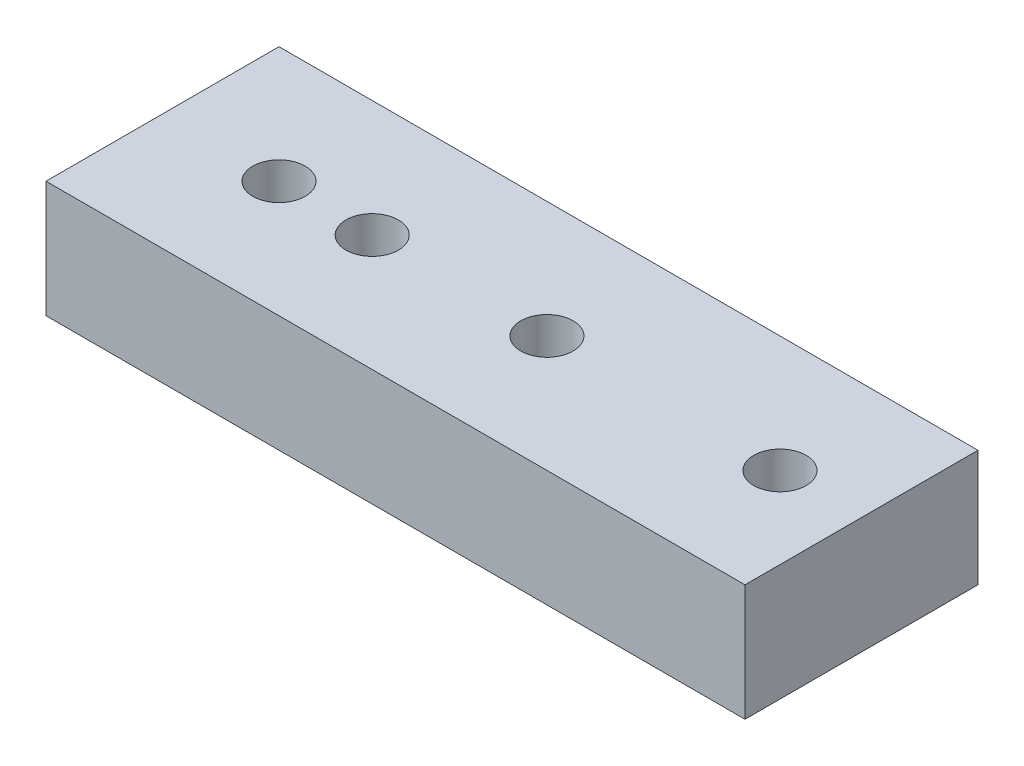
ISO-10303-21;
HEADER;
FILE_DESCRIPTION(('STEP AP214'),'2;1');
FILE_NAME('part.step','',(''),(''),'','','');
FILE_SCHEMA(('AUTOMOTIVE_DESIGN { 1 0 10303 214 1 1 1 1 }'));
ENDSEC;
DATA;
#1=APPLICATION_CONTEXT('core data for automotive mechanical design processes');
#2=APPLICATION_PROTOCOL_DEFINITION('international standard','automotive_design',2000,#1);
#3=PRODUCT_CONTEXT('',#1,'mechanical');
#4=PRODUCT('Part','Part','',(#3));
#5=PRODUCT_RELATED_PRODUCT_CATEGORY('part','',(#4));
#6=PRODUCT_DEFINITION_FORMATION('','',#4);
#7=PRODUCT_DEFINITION_CONTEXT('part definition',#1,'design');
#8=PRODUCT_DEFINITION('design','',#6,#7);
#9=PRODUCT_DEFINITION_SHAPE('','',#8);
#10=(LENGTH_UNIT() NAMED_UNIT(*) SI_UNIT(.MILLI.,.METRE.));
#11=(NAMED_UNIT(*) PLANE_ANGLE_UNIT() SI_UNIT($,.RADIAN.));
#12=(NAMED_UNIT(*) SI_UNIT($,.STERADIAN.) SOLID_ANGLE_UNIT());
#13=UNCERTAINTY_MEASURE_WITH_UNIT(LENGTH_MEASURE(1.E-05),#10,'distance_accuracy_value','');
#14=(GEOMETRIC_REPRESENTATION_CONTEXT(3) GLOBAL_UNCERTAINTY_ASSIGNED_CONTEXT((#13)) GLOBAL_UNIT_ASSIGNED_CONTEXT((#10,
#11,#12)) REPRESENTATION_CONTEXT('',''));
#15=CARTESIAN_POINT('',(0.,0.,0.));
#16=DIRECTION('',(0.,0.,1.));
#17=DIRECTION('',(1.,0.,0.));
#18=AXIS2_PLACEMENT_3D('',#15,#16,#17);
#19=CARTESIAN_POINT('',(0.,10.,0.));
#20=DIRECTION('',(0.,-1.,0.));
#21=DIRECTION('',(0.,0.,-1.));
#22=AXIS2_PLACEMENT_3D('',#19,#20,#21);
#23=CYLINDRICAL_SURFACE('',#22,2.25);
#24=CARTESIAN_POINT('',(0.,10.,0.));
#25=DIRECTION('',(0.,1.,0.));
#26=DIRECTION('',(0.,0.,1.));
#27=AXIS2_PLACEMENT_3D('',#24,#25,#26);
#28=CIRCLE('',#27,2.25);
#29=CARTESIAN_POINT('',(0.,10.,2.25));
#30=VERTEX_POINT('',#29);
#31=EDGE_CURVE('E312',#30,#30,#28,.T.);
#32=ORIENTED_EDGE('',*,*,#31,.T.);
#33=EDGE_LOOP('',(#32));
#34=FACE_BOUND('',#33,.T.);
#35=CARTESIAN_POINT('',(0.,3.2,0.));
#36=DIRECTION('',(0.,-1.,0.));
#37=DIRECTION('',(0.,0.,-1.));
#38=AXIS2_PLACEMENT_3D('',#35,#36,#37);
#39=CIRCLE('',#38,2.25);
#40=CARTESIAN_POINT('',(0.,3.2,-2.25));
#41=VERTEX_POINT('',#40);
#42=EDGE_CURVE('E43',#41,#41,#39,.T.);
#43=ORIENTED_EDGE('',*,*,#42,.T.);
#44=EDGE_LOOP('',(#43));
#45=FACE_BOUND('',#44,.T.);
#46=ADVANCED_FACE('F39',(#34,#45),#23,.F.);
#47=CARTESIAN_POINT('',(-8.,10.,0.));
#48=DIRECTION('',(0.,-1.,0.));
#49=DIRECTION('',(0.,0.,-1.));
#50=AXIS2_PLACEMENT_3D('',#47,#48,#49);
#51=CYLINDRICAL_SURFACE('',#50,2.25);
#52=CARTESIAN_POINT('',(-8.,10.,0.));
#53=DIRECTION('',(0.,1.,0.));
#54=DIRECTION('',(0.,0.,1.));
#55=AXIS2_PLACEMENT_3D('',#52,#53,#54);
#56=CIRCLE('',#55,2.25);
#57=CARTESIAN_POINT('',(-8.,10.,2.25));
#58=VERTEX_POINT('',#57);
#59=EDGE_CURVE('E305',#58,#58,#56,.T.);
#60=ORIENTED_EDGE('',*,*,#59,.T.);
#61=EDGE_LOOP('',(#60));
#62=FACE_BOUND('',#61,.T.);
#63=CARTESIAN_POINT('',(-8.,3.2,0.));
#64=DIRECTION('',(0.,-1.,0.));
#65=DIRECTION('',(0.,0.,-1.));
#66=AXIS2_PLACEMENT_3D('',#63,#64,#65);
#67=CIRCLE('',#66,2.25);
#68=CARTESIAN_POINT('',(-8.,3.2,-2.25));
#69=VERTEX_POINT('',#68);
#70=EDGE_CURVE('E217',#69,#69,#67,.T.);
#71=ORIENTED_EDGE('',*,*,#70,.T.);
#72=EDGE_LOOP('',(#71));
#73=FACE_BOUND('',#72,.T.);
#74=ADVANCED_FACE('F370',(#62,#73),#51,.F.);
#75=CARTESIAN_POINT('',(0.,10.,0.));
#76=DIRECTION('',(0.,1.,0.));
#77=DIRECTION('',(0.,0.,1.));
#78=AXIS2_PLACEMENT_3D('',#75,#76,#77);
#79=PLANE('',#78);
#80=CARTESIAN_POINT('',(35.,10.,0.));
#81=DIRECTION('',(0.,1.,0.));
#82=DIRECTION('',(0.,0.,1.));
#83=AXIS2_PLACEMENT_3D('',#80,#81,#82);
#84=CIRCLE('',#83,2.25);
#85=CARTESIAN_POINT('',(35.,10.,2.25));
#86=VERTEX_POINT('',#85);
#87=EDGE_CURVE('E301',#86,#86,#84,.T.);
#88=ORIENTED_EDGE('',*,*,#87,.F.);
#89=EDGE_LOOP('',(#88));
#90=FACE_BOUND('',#89,.T.);
#91=ORIENTED_EDGE('',*,*,#31,.F.);
#92=EDGE_LOOP('',(#91));
#93=FACE_BOUND('',#92,.T.);
#94=DIRECTION('',(0.,0.,1.));
#95=VECTOR('',#94,1.);
#96=CARTESIAN_POINT('',(-18.,10.,-10.));
#97=LINE('',#96,#95);
#98=CARTESIAN_POINT('',(-18.,10.,-10.));
#99=VERTEX_POINT('',#98);
#100=CARTESIAN_POINT('',(-18.,10.,10.));
#101=VERTEX_POINT('',#100);
#102=EDGE_CURVE('E317',#99,#101,#97,.T.);
#103=ORIENTED_EDGE('',*,*,#102,.T.);
#104=DIRECTION('',(1.,0.,0.));
#105=VECTOR('',#104,1.);
#106=CARTESIAN_POINT('',(-18.,10.,10.));
#107=LINE('',#106,#105);
#108=CARTESIAN_POINT('',(42.,10.,10.));
#109=VERTEX_POINT('',#108);
#110=EDGE_CURVE('E321',#101,#109,#107,.T.);
#111=ORIENTED_EDGE('',*,*,#110,.T.);
#112=DIRECTION('',(0.,0.,-1.));
#113=VECTOR('',#112,1.);
#114=CARTESIAN_POINT('',(42.,10.,-10.));
#115=LINE('',#114,#113);
#116=CARTESIAN_POINT('',(42.,10.,-10.));
#117=VERTEX_POINT('',#116);
#118=EDGE_CURVE('E325',#109,#117,#115,.T.);
#119=ORIENTED_EDGE('',*,*,#118,.T.);
#120=DIRECTION('',(-1.,0.,0.));
#121=VECTOR('',#120,1.);
#122=CARTESIAN_POINT('',(-18.,10.,-10.));
#123=LINE('',#122,#121);
#124=EDGE_CURVE('E328',#117,#99,#123,.T.);
#125=ORIENTED_EDGE('',*,*,#124,.T.);
#126=EDGE_LOOP('',(#103,#111,#119,#125));
#127=FACE_BOUND('',#126,.T.);
#128=ORIENTED_EDGE('',*,*,#59,.F.);
#129=EDGE_LOOP('',(#128));
#130=FACE_BOUND('',#129,.T.);
#131=CARTESIAN_POINT('',(15.,10.,0.));
#132=DIRECTION('',(0.,1.,0.));
#133=DIRECTION('',(0.,0.,1.));
#134=AXIS2_PLACEMENT_3D('',#131,#132,#133);
#135=CIRCLE('',#134,2.25);
#136=CARTESIAN_POINT('',(15.,10.,2.25));
#137=VERTEX_POINT('',#136);
#138=EDGE_CURVE('E292',#137,#137,#135,.T.);
#139=ORIENTED_EDGE('',*,*,#138,.F.);
#140=EDGE_LOOP('',(#139));
#141=FACE_BOUND('',#140,.T.);
#142=ADVANCED_FACE('F376',(#90,#93,#127,#130,#141),#79,.T.);
#143=CARTESIAN_POINT('',(0.,0.,0.));
#144=DIRECTION('',(0.,1.,0.));
#145=DIRECTION('',(0.,0.,1.));
#146=AXIS2_PLACEMENT_3D('',#143,#144,#145);
#147=PLANE('',#146);
#148=DIRECTION('',(0.,0.,-1.));
#149=VECTOR('',#148,1.);
#150=CARTESIAN_POINT('',(-3.5,0.,2.02072594216369));
#151=LINE('',#150,#149);
#152=CARTESIAN_POINT('',(-3.5,0.,2.02072594216369));
#153=VERTEX_POINT('',#152);
#154=CARTESIAN_POINT('',(-3.5,0.,-2.02072594216369));
#155=VERTEX_POINT('',#154);
#156=EDGE_CURVE('E199',#153,#155,#151,.T.);
#157=ORIENTED_EDGE('',*,*,#156,.F.);
#158=DIRECTION('',(-0.866025403784439,0.,-0.5));
#159=VECTOR('',#158,1.);
#160=CARTESIAN_POINT('',(0.,0.,4.04145188432738));
#161=LINE('',#160,#159);
#162=CARTESIAN_POINT('',(0.,0.,4.04145188432738));
#163=VERTEX_POINT('',#162);
#164=EDGE_CURVE('E57',#163,#153,#161,.T.);
#165=ORIENTED_EDGE('',*,*,#164,.F.);
#166=DIRECTION('',(-0.866025403784438,0.,0.5));
#167=VECTOR('',#166,1.);
#168=CARTESIAN_POINT('',(3.5,0.,2.02072594216369));
#169=LINE('',#168,#167);
#170=CARTESIAN_POINT('',(3.5,0.,2.02072594216369));
#171=VERTEX_POINT('',#170);
#172=EDGE_CURVE('E179',#171,#163,#169,.T.);
#173=ORIENTED_EDGE('',*,*,#172,.F.);
#174=DIRECTION('',(0.,0.,1.));
#175=VECTOR('',#174,1.);
#176=CARTESIAN_POINT('',(3.5,0.,-2.02072594216369));
#177=LINE('',#176,#175);
#178=CARTESIAN_POINT('',(3.5,0.,-2.02072594216369));
#179=VERTEX_POINT('',#178);
#180=EDGE_CURVE('E183',#179,#171,#177,.T.);
#181=ORIENTED_EDGE('',*,*,#180,.F.);
#182=DIRECTION('',(0.866025403784439,0.,0.5));
#183=VECTOR('',#182,1.);
#184=CARTESIAN_POINT('',(0.,0.,-4.04145188432738));
#185=LINE('',#184,#183);
#186=CARTESIAN_POINT('',(0.,0.,-4.04145188432738));
#187=VERTEX_POINT('',#186);
#188=EDGE_CURVE('E207',#187,#179,#185,.T.);
#189=ORIENTED_EDGE('',*,*,#188,.F.);
#190=DIRECTION('',(0.866025403784438,0.,-0.5));
#191=VECTOR('',#190,1.);
#192=CARTESIAN_POINT('',(-3.5,0.,-2.02072594216369));
#193=LINE('',#192,#191);
#194=EDGE_CURVE('E203',#155,#187,#193,.T.);
#195=ORIENTED_EDGE('',*,*,#194,.F.);
#196=EDGE_LOOP('',(#157,#165,#173,#181,#189,#195));
#197=FACE_BOUND('',#196,.T.);
#198=DIRECTION('',(-0.866025403784439,0.,0.499999999999999));
#199=VECTOR('',#198,1.);
#200=CARTESIAN_POINT('',(-4.5,0.,2.02072594216369));
#201=LINE('',#200,#199);
#202=CARTESIAN_POINT('',(-4.5,0.,2.02072594216369));
#203=VERTEX_POINT('',#202);
#204=CARTESIAN_POINT('',(-8.,0.,4.04145188432738));
#205=VERTEX_POINT('',#204);
#206=EDGE_CURVE('E257',#203,#205,#201,.T.);
#207=ORIENTED_EDGE('',*,*,#206,.F.);
#208=DIRECTION('',(0.,0.,1.));
#209=VECTOR('',#208,1.);
#210=CARTESIAN_POINT('',(-4.5,0.,-2.02072594216369));
#211=LINE('',#210,#209);
#212=CARTESIAN_POINT('',(-4.5,0.,-2.02072594216369));
#213=VERTEX_POINT('',#212);
#214=EDGE_CURVE('E65',#213,#203,#211,.T.);
#215=ORIENTED_EDGE('',*,*,#214,.F.);
#216=DIRECTION('',(0.866025403784439,0.,0.5));
#217=VECTOR('',#216,1.);
#218=CARTESIAN_POINT('',(-8.,0.,-4.04145188432738));
#219=LINE('',#218,#217);
#220=CARTESIAN_POINT('',(-8.,0.,-4.04145188432738));
#221=VERTEX_POINT('',#220);
#222=EDGE_CURVE('E234',#221,#213,#219,.T.);
#223=ORIENTED_EDGE('',*,*,#222,.F.);
#224=DIRECTION('',(0.866025403784438,0.,-0.5));
#225=VECTOR('',#224,1.);
#226=CARTESIAN_POINT('',(-11.5,0.,-2.02072594216369));
#227=LINE('',#226,#225);
#228=CARTESIAN_POINT('',(-11.5,0.,-2.02072594216369));
#229=VERTEX_POINT('',#228);
#230=EDGE_CURVE('E269',#229,#221,#227,.T.);
#231=ORIENTED_EDGE('',*,*,#230,.F.);
#232=DIRECTION('',(0.,0.,-1.));
#233=VECTOR('',#232,1.);
#234=CARTESIAN_POINT('',(-11.5,0.,2.02072594216369));
#235=LINE('',#234,#233);
#236=CARTESIAN_POINT('',(-11.5,0.,2.02072594216369));
#237=VERTEX_POINT('',#236);
#238=EDGE_CURVE('E265',#237,#229,#235,.T.);
#239=ORIENTED_EDGE('',*,*,#238,.F.);
#240=DIRECTION('',(-0.866025403784438,0.,-0.5));
#241=VECTOR('',#240,1.);
#242=CARTESIAN_POINT('',(-8.,0.,4.04145188432738));
#243=LINE('',#242,#241);
#244=EDGE_CURVE('E261',#205,#237,#243,.T.);
#245=ORIENTED_EDGE('',*,*,#244,.F.);
#246=EDGE_LOOP('',(#207,#215,#223,#231,#239,#245));
#247=FACE_BOUND('',#246,.T.);
#248=DIRECTION('',(0.,0.,1.));
#249=VECTOR('',#248,1.);
#250=CARTESIAN_POINT('',(-18.,0.,-10.));
#251=LINE('',#250,#249);
#252=CARTESIAN_POINT('',(-18.,0.,-10.));
#253=VERTEX_POINT('',#252);
#254=CARTESIAN_POINT('',(-18.,0.,10.));
#255=VERTEX_POINT('',#254);
#256=EDGE_CURVE('E316',#253,#255,#251,.T.);
#257=ORIENTED_EDGE('',*,*,#256,.F.);
#258=DIRECTION('',(-1.,0.,0.));
#259=VECTOR('',#258,1.);
#260=CARTESIAN_POINT('',(-18.,0.,-10.));
#261=LINE('',#260,#259);
#262=CARTESIAN_POINT('',(42.,0.,-10.));
#263=VERTEX_POINT('',#262);
#264=EDGE_CURVE('E322',#263,#253,#261,.T.);
#265=ORIENTED_EDGE('',*,*,#264,.F.);
#266=DIRECTION('',(0.,0.,-1.));
#267=VECTOR('',#266,1.);
#268=CARTESIAN_POINT('',(42.,0.,-10.));
#269=LINE('',#268,#267);
#270=CARTESIAN_POINT('',(42.,0.,10.));
#271=VERTEX_POINT('',#270);
#272=EDGE_CURVE('E338',#271,#263,#269,.T.);
#273=ORIENTED_EDGE('',*,*,#272,.F.);
#274=DIRECTION('',(1.,0.,0.));
#275=VECTOR('',#274,1.);
#276=CARTESIAN_POINT('',(-18.,0.,10.));
#277=LINE('',#276,#275);
#278=EDGE_CURVE('E335',#255,#271,#277,.T.);
#279=ORIENTED_EDGE('',*,*,#278,.F.);
#280=EDGE_LOOP('',(#257,#265,#273,#279));
#281=FACE_BOUND('',#280,.T.);
#282=CARTESIAN_POINT('',(35.,0.,0.));
#283=DIRECTION('',(0.,1.,0.));
#284=DIRECTION('',(0.,0.,1.));
#285=AXIS2_PLACEMENT_3D('',#282,#283,#284);
#286=CIRCLE('',#285,2.25);
#287=CARTESIAN_POINT('',(35.,0.,2.25));
#288=VERTEX_POINT('',#287);
#289=EDGE_CURVE('E296',#288,#288,#286,.T.);
#290=ORIENTED_EDGE('',*,*,#289,.T.);
#291=EDGE_LOOP('',(#290));
#292=FACE_BOUND('',#291,.T.);
#293=CARTESIAN_POINT('',(15.,0.,0.));
#294=DIRECTION('',(0.,1.,0.));
#295=DIRECTION('',(0.,0.,1.));
#296=AXIS2_PLACEMENT_3D('',#293,#294,#295);
#297=CIRCLE('',#296,2.25);
#298=CARTESIAN_POINT('',(15.,0.,2.25));
#299=VERTEX_POINT('',#298);
#300=EDGE_CURVE('E297',#299,#299,#297,.T.);
#301=ORIENTED_EDGE('',*,*,#300,.T.);
#302=EDGE_LOOP('',(#301));
#303=FACE_BOUND('',#302,.T.);
#304=ADVANCED_FACE('F383',(#197,#247,#281,#292,#303),#147,.F.);
#305=CARTESIAN_POINT('',(-18.,10.,-10.));
#306=DIRECTION('',(1.,0.,0.));
#307=DIRECTION('',(0.,0.,-1.));
#308=AXIS2_PLACEMENT_3D('',#305,#306,#307);
#309=PLANE('',#308);
#310=ORIENTED_EDGE('',*,*,#256,.T.);
#311=DIRECTION('',(0.,-1.,0.));
#312=VECTOR('',#311,1.);
#313=CARTESIAN_POINT('',(-18.,10.,10.));
#314=LINE('',#313,#312);
#315=EDGE_CURVE('E11',#101,#255,#314,.T.);
#316=ORIENTED_EDGE('',*,*,#315,.F.);
#317=ORIENTED_EDGE('',*,*,#102,.F.);
#318=DIRECTION('',(0.,-1.,0.));
#319=VECTOR('',#318,1.);
#320=CARTESIAN_POINT('',(-18.,10.,-10.));
#321=LINE('',#320,#319);
#322=EDGE_CURVE('E331',#99,#253,#321,.T.);
#323=ORIENTED_EDGE('',*,*,#322,.T.);
#324=EDGE_LOOP('',(#310,#316,#317,#323));
#325=FACE_BOUND('',#324,.T.);
#326=ADVANCED_FACE('F41',(#325),#309,.F.);
#327=CARTESIAN_POINT('',(-18.,10.,10.));
#328=DIRECTION('',(0.,0.,-1.));
#329=DIRECTION('',(-1.,0.,0.));
#330=AXIS2_PLACEMENT_3D('',#327,#328,#329);
#331=PLANE('',#330);
#332=ORIENTED_EDGE('',*,*,#278,.T.);
#333=DIRECTION('',(0.,-1.,0.));
#334=VECTOR('',#333,1.);
#335=CARTESIAN_POINT('',(42.,10.,10.));
#336=LINE('',#335,#334);
#337=EDGE_CURVE('E49',#109,#271,#336,.T.);
#338=ORIENTED_EDGE('',*,*,#337,.F.);
#339=ORIENTED_EDGE('',*,*,#110,.F.);
#340=ORIENTED_EDGE('',*,*,#315,.T.);
#341=EDGE_LOOP('',(#332,#338,#339,#340));
#342=FACE_BOUND('',#341,.T.);
#343=ADVANCED_FACE('F395',(#342),#331,.F.);
#344=CARTESIAN_POINT('',(42.,10.,-10.));
#345=DIRECTION('',(-1.,0.,0.));
#346=DIRECTION('',(0.,0.,1.));
#347=AXIS2_PLACEMENT_3D('',#344,#345,#346);
#348=PLANE('',#347);
#349=ORIENTED_EDGE('',*,*,#272,.T.);
#350=DIRECTION('',(0.,-1.,0.));
#351=VECTOR('',#350,1.);
#352=CARTESIAN_POINT('',(42.,10.,-10.));
#353=LINE('',#352,#351);
#354=EDGE_CURVE('E346',#117,#263,#353,.T.);
#355=ORIENTED_EDGE('',*,*,#354,.F.);
#356=ORIENTED_EDGE('',*,*,#118,.F.);
#357=ORIENTED_EDGE('',*,*,#337,.T.);
#358=EDGE_LOOP('',(#349,#355,#356,#357));
#359=FACE_BOUND('',#358,.T.);
#360=ADVANCED_FACE('F392',(#359),#348,.F.);
#361=CARTESIAN_POINT('',(-18.,10.,-10.));
#362=DIRECTION('',(0.,0.,1.));
#363=DIRECTION('',(1.,0.,0.));
#364=AXIS2_PLACEMENT_3D('',#361,#362,#363);
#365=PLANE('',#364);
#366=ORIENTED_EDGE('',*,*,#264,.T.);
#367=ORIENTED_EDGE('',*,*,#322,.F.);
#368=ORIENTED_EDGE('',*,*,#124,.F.);
#369=ORIENTED_EDGE('',*,*,#354,.T.);
#370=EDGE_LOOP('',(#366,#367,#368,#369));
#371=FACE_BOUND('',#370,.T.);
#372=ADVANCED_FACE('F388',(#371),#365,.F.);
#373=CARTESIAN_POINT('',(35.,10.,0.));
#374=DIRECTION('',(0.,-1.,0.));
#375=DIRECTION('',(0.,0.,-1.));
#376=AXIS2_PLACEMENT_3D('',#373,#374,#375);
#377=CYLINDRICAL_SURFACE('',#376,2.25);
#378=ORIENTED_EDGE('',*,*,#87,.T.);
#379=EDGE_LOOP('',(#378));
#380=FACE_BOUND('',#379,.T.);
#381=ORIENTED_EDGE('',*,*,#289,.F.);
#382=EDGE_LOOP('',(#381));
#383=FACE_BOUND('',#382,.T.);
#384=ADVANCED_FACE('F391',(#380,#383),#377,.F.);
#385=CARTESIAN_POINT('',(15.,10.,0.));
#386=DIRECTION('',(0.,-1.,0.));
#387=DIRECTION('',(0.,0.,-1.));
#388=AXIS2_PLACEMENT_3D('',#385,#386,#387);
#389=CYLINDRICAL_SURFACE('',#388,2.25);
#390=ORIENTED_EDGE('',*,*,#138,.T.);
#391=EDGE_LOOP('',(#390));
#392=FACE_BOUND('',#391,.T.);
#393=ORIENTED_EDGE('',*,*,#300,.F.);
#394=EDGE_LOOP('',(#393));
#395=FACE_BOUND('',#394,.T.);
#396=ADVANCED_FACE('F421',(#392,#395),#389,.F.);
#397=CARTESIAN_POINT('',(-4.5,3.2,-2.02072594216369));
#398=DIRECTION('',(1.,0.,0.));
#399=DIRECTION('',(0.,0.,-1.));
#400=AXIS2_PLACEMENT_3D('',#397,#398,#399);
#401=PLANE('',#400);
#402=ORIENTED_EDGE('',*,*,#214,.T.);
#403=DIRECTION('',(0.,-1.,0.));
#404=VECTOR('',#403,1.);
#405=CARTESIAN_POINT('',(-4.5,3.2,2.02072594216369));
#406=LINE('',#405,#404);
#407=CARTESIAN_POINT('',(-4.5,3.2,2.02072594216369));
#408=VERTEX_POINT('',#407);
#409=EDGE_CURVE('E254',#408,#203,#406,.T.);
#410=ORIENTED_EDGE('',*,*,#409,.F.);
#411=DIRECTION('',(0.,0.,1.));
#412=VECTOR('',#411,1.);
#413=CARTESIAN_POINT('',(-4.5,3.2,-2.02072594216369));
#414=LINE('',#413,#412);
#415=CARTESIAN_POINT('',(-4.5,3.2,-2.02072594216369));
#416=VERTEX_POINT('',#415);
#417=EDGE_CURVE('E229',#416,#408,#414,.T.);
#418=ORIENTED_EDGE('',*,*,#417,.F.);
#419=DIRECTION('',(0.,-1.,0.));
#420=VECTOR('',#419,1.);
#421=CARTESIAN_POINT('',(-4.5,3.2,-2.02072594216369));
#422=LINE('',#421,#420);
#423=EDGE_CURVE('E200',#416,#213,#422,.T.);
#424=ORIENTED_EDGE('',*,*,#423,.T.);
#425=EDGE_LOOP('',(#402,#410,#418,#424));
#426=FACE_BOUND('',#425,.T.);
#427=ADVANCED_FACE('F424',(#426),#401,.F.);
#428=CARTESIAN_POINT('',(-8.,3.2,-4.04145188432738));
#429=DIRECTION('',(0.5,0.,-0.866025403784439));
#430=DIRECTION('',(-0.866025403784439,0.,-0.5));
#431=AXIS2_PLACEMENT_3D('',#428,#429,#430);
#432=PLANE('',#431);
#433=ORIENTED_EDGE('',*,*,#222,.T.);
#434=ORIENTED_EDGE('',*,*,#423,.F.);
#435=DIRECTION('',(0.866025403784439,0.,0.5));
#436=VECTOR('',#435,1.);
#437=CARTESIAN_POINT('',(-8.,3.2,-4.04145188432738));
#438=LINE('',#437,#436);
#439=CARTESIAN_POINT('',(-8.,3.2,-4.04145188432738));
#440=VERTEX_POINT('',#439);
#441=EDGE_CURVE('E250',#440,#416,#438,.T.);
#442=ORIENTED_EDGE('',*,*,#441,.F.);
#443=DIRECTION('',(0.,-1.,0.));
#444=VECTOR('',#443,1.);
#445=CARTESIAN_POINT('',(-8.,3.2,-4.04145188432738));
#446=LINE('',#445,#444);
#447=EDGE_CURVE('E278',#440,#221,#446,.T.);
#448=ORIENTED_EDGE('',*,*,#447,.T.);
#449=EDGE_LOOP('',(#433,#434,#442,#448));
#450=FACE_BOUND('',#449,.T.);
#451=ADVANCED_FACE('F432',(#450),#432,.F.);
#452=CARTESIAN_POINT('',(-11.5,3.2,-2.02072594216369));
#453=DIRECTION('',(-0.5,0.,-0.866025403784438));
#454=DIRECTION('',(-0.866025403784438,0.,0.5));
#455=AXIS2_PLACEMENT_3D('',#452,#453,#454);
#456=PLANE('',#455);
#457=ORIENTED_EDGE('',*,*,#230,.T.);
#458=ORIENTED_EDGE('',*,*,#447,.F.);
#459=DIRECTION('',(0.866025403784438,0.,-0.5));
#460=VECTOR('',#459,1.);
#461=CARTESIAN_POINT('',(-11.5,3.2,-2.02072594216369));
#462=LINE('',#461,#460);
#463=CARTESIAN_POINT('',(-11.5,3.2,-2.02072594216369));
#464=VERTEX_POINT('',#463);
#465=EDGE_CURVE('E246',#464,#440,#462,.T.);
#466=ORIENTED_EDGE('',*,*,#465,.F.);
#467=DIRECTION('',(0.,-1.,0.));
#468=VECTOR('',#467,1.);
#469=CARTESIAN_POINT('',(-11.5,3.2,-2.02072594216369));
#470=LINE('',#469,#468);
#471=EDGE_CURVE('E281',#464,#229,#470,.T.);
#472=ORIENTED_EDGE('',*,*,#471,.T.);
#473=EDGE_LOOP('',(#457,#458,#466,#472));
#474=FACE_BOUND('',#473,.T.);
#475=ADVANCED_FACE('F448',(#474),#456,.F.);
#476=CARTESIAN_POINT('',(-11.5,3.2,2.02072594216369));
#477=DIRECTION('',(-1.,0.,0.));
#478=DIRECTION('',(0.,0.,1.));
#479=AXIS2_PLACEMENT_3D('',#476,#477,#478);
#480=PLANE('',#479);
#481=ORIENTED_EDGE('',*,*,#238,.T.);
#482=ORIENTED_EDGE('',*,*,#471,.F.);
#483=DIRECTION('',(0.,0.,-1.));
#484=VECTOR('',#483,1.);
#485=CARTESIAN_POINT('',(-11.5,3.2,2.02072594216369));
#486=LINE('',#485,#484);
#487=CARTESIAN_POINT('',(-11.5,3.2,2.02072594216369));
#488=VERTEX_POINT('',#487);
#489=EDGE_CURVE('E242',#488,#464,#486,.T.);
#490=ORIENTED_EDGE('',*,*,#489,.F.);
#491=DIRECTION('',(0.,-1.,0.));
#492=VECTOR('',#491,1.);
#493=CARTESIAN_POINT('',(-11.5,3.2,2.02072594216369));
#494=LINE('',#493,#492);
#495=EDGE_CURVE('E284',#488,#237,#494,.T.);
#496=ORIENTED_EDGE('',*,*,#495,.T.);
#497=EDGE_LOOP('',(#481,#482,#490,#496));
#498=FACE_BOUND('',#497,.T.);
#499=ADVANCED_FACE('F444',(#498),#480,.F.);
#500=CARTESIAN_POINT('',(-8.,3.2,4.04145188432738));
#501=DIRECTION('',(-0.5,0.,0.866025403784438));
#502=DIRECTION('',(0.866025403784438,0.,0.5));
#503=AXIS2_PLACEMENT_3D('',#500,#501,#502);
#504=PLANE('',#503);
#505=ORIENTED_EDGE('',*,*,#244,.T.);
#506=ORIENTED_EDGE('',*,*,#495,.F.);
#507=DIRECTION('',(-0.866025403784438,0.,-0.5));
#508=VECTOR('',#507,1.);
#509=CARTESIAN_POINT('',(-8.,3.2,4.04145188432738));
#510=LINE('',#509,#508);
#511=CARTESIAN_POINT('',(-8.,3.2,4.04145188432738));
#512=VERTEX_POINT('',#511);
#513=EDGE_CURVE('E238',#512,#488,#510,.T.);
#514=ORIENTED_EDGE('',*,*,#513,.F.);
#515=DIRECTION('',(0.,-1.,0.));
#516=VECTOR('',#515,1.);
#517=CARTESIAN_POINT('',(-8.,3.2,4.04145188432738));
#518=LINE('',#517,#516);
#519=EDGE_CURVE('E287',#512,#205,#518,.T.);
#520=ORIENTED_EDGE('',*,*,#519,.T.);
#521=EDGE_LOOP('',(#505,#506,#514,#520));
#522=FACE_BOUND('',#521,.T.);
#523=ADVANCED_FACE('F440',(#522),#504,.F.);
#524=CARTESIAN_POINT('',(-4.5,3.2,2.02072594216369));
#525=DIRECTION('',(0.499999999999999,0.,0.866025403784439));
#526=DIRECTION('',(0.866025403784439,0.,-0.499999999999999));
#527=AXIS2_PLACEMENT_3D('',#524,#525,#526);
#528=PLANE('',#527);
#529=ORIENTED_EDGE('',*,*,#206,.T.);
#530=ORIENTED_EDGE('',*,*,#519,.F.);
#531=DIRECTION('',(-0.866025403784439,0.,0.499999999999999));
#532=VECTOR('',#531,1.);
#533=CARTESIAN_POINT('',(-4.5,3.2,2.02072594216369));
#534=LINE('',#533,#532);
#535=EDGE_CURVE('E233',#408,#512,#534,.T.);
#536=ORIENTED_EDGE('',*,*,#535,.F.);
#537=ORIENTED_EDGE('',*,*,#409,.T.);
#538=EDGE_LOOP('',(#529,#530,#536,#537));
#539=FACE_BOUND('',#538,.T.);
#540=ADVANCED_FACE('F436',(#539),#528,.F.);
#541=CARTESIAN_POINT('',(0.,3.2,0.));
#542=DIRECTION('',(0.,-1.,0.));
#543=DIRECTION('',(0.,0.,-1.));
#544=AXIS2_PLACEMENT_3D('',#541,#542,#543);
#545=PLANE('',#544);
#546=ORIENTED_EDGE('',*,*,#70,.F.);
#547=EDGE_LOOP('',(#546));
#548=FACE_BOUND('',#547,.T.);
#549=ORIENTED_EDGE('',*,*,#417,.T.);
#550=ORIENTED_EDGE('',*,*,#535,.T.);
#551=ORIENTED_EDGE('',*,*,#513,.T.);
#552=ORIENTED_EDGE('',*,*,#489,.T.);
#553=ORIENTED_EDGE('',*,*,#465,.T.);
#554=ORIENTED_EDGE('',*,*,#441,.T.);
#555=EDGE_LOOP('',(#549,#550,#551,#552,#553,#554));
#556=FACE_BOUND('',#555,.T.);
#557=ADVANCED_FACE('F439',(#548,#556),#545,.T.);
#558=CARTESIAN_POINT('',(0.,3.2,4.04145188432738));
#559=DIRECTION('',(-0.5,0.,0.866025403784439));
#560=DIRECTION('',(0.866025403784439,0.,0.5));
#561=AXIS2_PLACEMENT_3D('',#558,#559,#560);
#562=PLANE('',#561);
#563=ORIENTED_EDGE('',*,*,#164,.T.);
#564=DIRECTION('',(0.,-1.,0.));
#565=VECTOR('',#564,1.);
#566=CARTESIAN_POINT('',(-3.5,3.2,2.02072594216369));
#567=LINE('',#566,#565);
#568=CARTESIAN_POINT('',(-3.5,3.2,2.02072594216369));
#569=VERTEX_POINT('',#568);
#570=EDGE_CURVE('E153',#569,#153,#567,.T.);
#571=ORIENTED_EDGE('',*,*,#570,.F.);
#572=DIRECTION('',(-0.866025403784439,0.,-0.5));
#573=VECTOR('',#572,1.);
#574=CARTESIAN_POINT('',(0.,3.2,4.04145188432738));
#575=LINE('',#574,#573);
#576=CARTESIAN_POINT('',(0.,3.2,4.04145188432738));
#577=VERTEX_POINT('',#576);
#578=EDGE_CURVE('E157',#577,#569,#575,.T.);
#579=ORIENTED_EDGE('',*,*,#578,.F.);
#580=DIRECTION('',(0.,-1.,0.));
#581=VECTOR('',#580,1.);
#582=CARTESIAN_POINT('',(0.,3.2,4.04145188432738));
#583=LINE('',#582,#581);
#584=EDGE_CURVE('E214',#577,#163,#583,.T.);
#585=ORIENTED_EDGE('',*,*,#584,.T.);
#586=EDGE_LOOP('',(#563,#571,#579,#585));
#587=FACE_BOUND('',#586,.T.);
#588=ADVANCED_FACE('F155',(#587),#562,.F.);
#589=CARTESIAN_POINT('',(3.5,3.2,2.02072594216369));
#590=DIRECTION('',(0.5,0.,0.866025403784438));
#591=DIRECTION('',(0.866025403784439,0.,-0.5));
#592=AXIS2_PLACEMENT_3D('',#589,#590,#591);
#593=PLANE('',#592);
#594=ORIENTED_EDGE('',*,*,#172,.T.);
#595=ORIENTED_EDGE('',*,*,#584,.F.);
#596=DIRECTION('',(-0.866025403784438,0.,0.5));
#597=VECTOR('',#596,1.);
#598=CARTESIAN_POINT('',(3.5,3.2,2.02072594216369));
#599=LINE('',#598,#597);
#600=CARTESIAN_POINT('',(3.5,3.2,2.02072594216369));
#601=VERTEX_POINT('',#600);
#602=EDGE_CURVE('E164',#601,#577,#599,.T.);
#603=ORIENTED_EDGE('',*,*,#602,.F.);
#604=DIRECTION('',(0.,-1.,0.));
#605=VECTOR('',#604,1.);
#606=CARTESIAN_POINT('',(3.5,3.2,2.02072594216369));
#607=LINE('',#606,#605);
#608=EDGE_CURVE('E218',#601,#171,#607,.T.);
#609=ORIENTED_EDGE('',*,*,#608,.T.);
#610=EDGE_LOOP('',(#594,#595,#603,#609));
#611=FACE_BOUND('',#610,.T.);
#612=ADVANCED_FACE('F460',(#611),#593,.F.);
#613=CARTESIAN_POINT('',(3.5,3.2,-2.02072594216369));
#614=DIRECTION('',(1.,0.,0.));
#615=DIRECTION('',(0.,0.,-1.));
#616=AXIS2_PLACEMENT_3D('',#613,#614,#615);
#617=PLANE('',#616);
#618=ORIENTED_EDGE('',*,*,#180,.T.);
#619=ORIENTED_EDGE('',*,*,#608,.F.);
#620=DIRECTION('',(0.,0.,1.));
#621=VECTOR('',#620,1.);
#622=CARTESIAN_POINT('',(3.5,3.2,-2.02072594216369));
#623=LINE('',#622,#621);
#624=CARTESIAN_POINT('',(3.5,3.2,-2.02072594216369));
#625=VERTEX_POINT('',#624);
#626=EDGE_CURVE('E192',#625,#601,#623,.T.);
#627=ORIENTED_EDGE('',*,*,#626,.F.);
#628=DIRECTION('',(0.,-1.,0.));
#629=VECTOR('',#628,1.);
#630=CARTESIAN_POINT('',(3.5,3.2,-2.02072594216369));
#631=LINE('',#630,#629);
#632=EDGE_CURVE('E221',#625,#179,#631,.T.);
#633=ORIENTED_EDGE('',*,*,#632,.T.);
#634=EDGE_LOOP('',(#618,#619,#627,#633));
#635=FACE_BOUND('',#634,.T.);
#636=ADVANCED_FACE('F468',(#635),#617,.F.);
#637=CARTESIAN_POINT('',(0.,3.2,-4.04145188432738));
#638=DIRECTION('',(0.5,0.,-0.866025403784439));
#639=DIRECTION('',(-0.866025403784439,0.,-0.5));
#640=AXIS2_PLACEMENT_3D('',#637,#638,#639);
#641=PLANE('',#640);
#642=ORIENTED_EDGE('',*,*,#188,.T.);
#643=ORIENTED_EDGE('',*,*,#632,.F.);
#644=DIRECTION('',(0.866025403784439,0.,0.5));
#645=VECTOR('',#644,1.);
#646=CARTESIAN_POINT('',(0.,3.2,-4.04145188432738));
#647=LINE('',#646,#645);
#648=CARTESIAN_POINT('',(0.,3.2,-4.04145188432738));
#649=VERTEX_POINT('',#648);
#650=EDGE_CURVE('E188',#649,#625,#647,.T.);
#651=ORIENTED_EDGE('',*,*,#650,.F.);
#652=DIRECTION('',(0.,-1.,0.));
#653=VECTOR('',#652,1.);
#654=CARTESIAN_POINT('',(0.,3.2,-4.04145188432738));
#655=LINE('',#654,#653);
#656=EDGE_CURVE('E224',#649,#187,#655,.T.);
#657=ORIENTED_EDGE('',*,*,#656,.T.);
#658=EDGE_LOOP('',(#642,#643,#651,#657));
#659=FACE_BOUND('',#658,.T.);
#660=ADVANCED_FACE('F464',(#659),#641,.F.);
#661=CARTESIAN_POINT('',(-3.5,3.2,-2.02072594216369));
#662=DIRECTION('',(-0.5,0.,-0.866025403784438));
#663=DIRECTION('',(-0.866025403784439,0.,0.5));
#664=AXIS2_PLACEMENT_3D('',#661,#662,#663);
#665=PLANE('',#664);
#666=ORIENTED_EDGE('',*,*,#194,.T.);
#667=ORIENTED_EDGE('',*,*,#656,.F.);
#668=DIRECTION('',(0.866025403784438,0.,-0.5));
#669=VECTOR('',#668,1.);
#670=CARTESIAN_POINT('',(-3.5,3.2,-2.02072594216369));
#671=LINE('',#670,#669);
#672=CARTESIAN_POINT('',(-3.5,3.2,-2.02072594216369));
#673=VERTEX_POINT('',#672);
#674=EDGE_CURVE('E173',#673,#649,#671,.T.);
#675=ORIENTED_EDGE('',*,*,#674,.F.);
#676=DIRECTION('',(0.,-1.,0.));
#677=VECTOR('',#676,1.);
#678=CARTESIAN_POINT('',(-3.5,3.2,-2.02072594216369));
#679=LINE('',#678,#677);
#680=EDGE_CURVE('E163',#673,#155,#679,.T.);
#681=ORIENTED_EDGE('',*,*,#680,.T.);
#682=EDGE_LOOP('',(#666,#667,#675,#681));
#683=FACE_BOUND('',#682,.T.);
#684=ADVANCED_FACE('F366',(#683),#665,.F.);
#685=CARTESIAN_POINT('',(-3.5,3.2,2.02072594216369));
#686=DIRECTION('',(-1.,0.,0.));
#687=DIRECTION('',(0.,0.,1.));
#688=AXIS2_PLACEMENT_3D('',#685,#686,#687);
#689=PLANE('',#688);
#690=ORIENTED_EDGE('',*,*,#156,.T.);
#691=ORIENTED_EDGE('',*,*,#680,.F.);
#692=DIRECTION('',(0.,0.,-1.));
#693=VECTOR('',#692,1.);
#694=CARTESIAN_POINT('',(-3.5,3.2,2.02072594216369));
#695=LINE('',#694,#693);
#696=EDGE_CURVE('E167',#569,#673,#695,.T.);
#697=ORIENTED_EDGE('',*,*,#696,.F.);
#698=ORIENTED_EDGE('',*,*,#570,.T.);
#699=EDGE_LOOP('',(#690,#691,#697,#698));
#700=FACE_BOUND('',#699,.T.);
#701=ADVANCED_FACE('F168',(#700),#689,.F.);
#702=CARTESIAN_POINT('',(0.,3.2,0.));
#703=DIRECTION('',(0.,-1.,0.));
#704=DIRECTION('',(0.,0.,-1.));
#705=AXIS2_PLACEMENT_3D('',#702,#703,#704);
#706=PLANE('',#705);
#707=ORIENTED_EDGE('',*,*,#42,.F.);
#708=EDGE_LOOP('',(#707));
#709=FACE_BOUND('',#708,.T.);
#710=ORIENTED_EDGE('',*,*,#578,.T.);
#711=ORIENTED_EDGE('',*,*,#696,.T.);
#712=ORIENTED_EDGE('',*,*,#674,.T.);
#713=ORIENTED_EDGE('',*,*,#650,.T.);
#714=ORIENTED_EDGE('',*,*,#626,.T.);
#715=ORIENTED_EDGE('',*,*,#602,.T.);
#716=EDGE_LOOP('',(#710,#711,#712,#713,#714,#715));
#717=FACE_BOUND('',#716,.T.);
#718=ADVANCED_FACE('F175',(#709,#717),#706,.T.);
#719=CLOSED_SHELL('',(#46,#74,#142,#304,#326,#343,#360,#372,#384,#396,#427,#451,#475,#499,#523,
#540,#557,#588,#612,#636,#660,#684,#701,#718));
#720=MANIFOLD_SOLID_BREP('B2',#719);
#721=ADVANCED_BREP_SHAPE_REPRESENTATION('',(#18,#720),#14);
#722=SHAPE_DEFINITION_REPRESENTATION(#9,#721);
ENDSEC;
END-ISO-10303-21;
